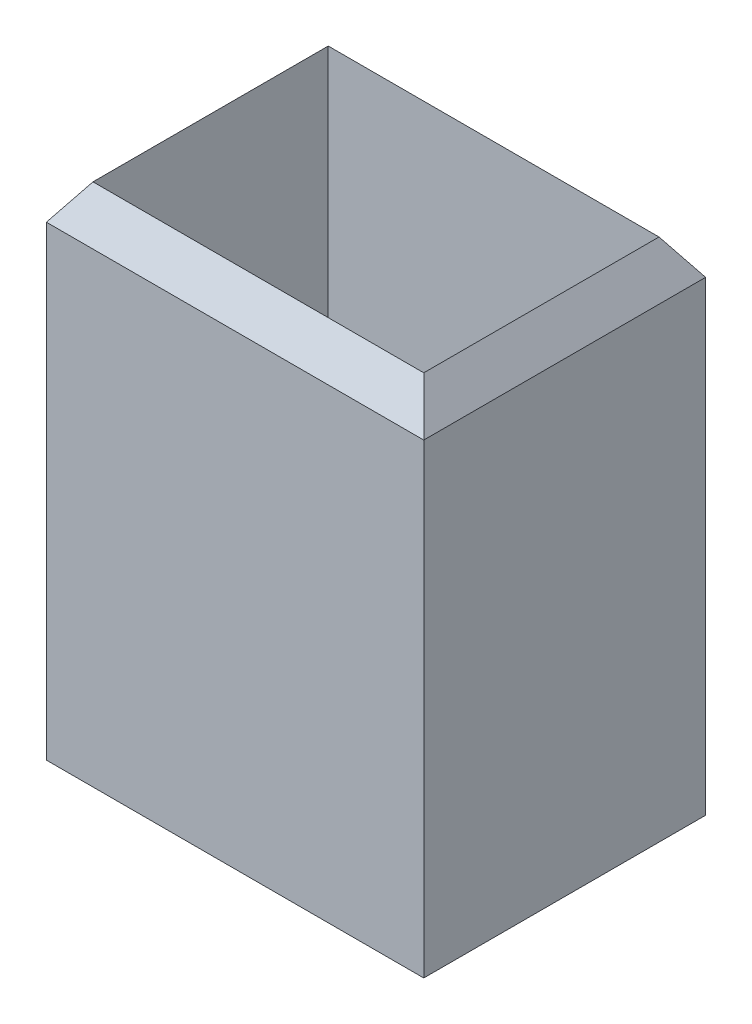
ISO-10303-21;
HEADER;
FILE_DESCRIPTION(('STEP AP214'),'2;1');
FILE_NAME('part.step','',(''),(''),'','','');
FILE_SCHEMA(('AUTOMOTIVE_DESIGN { 1 0 10303 214 1 1 1 1 }'));
ENDSEC;
DATA;
#1=APPLICATION_CONTEXT('core data for automotive mechanical design processes');
#2=APPLICATION_PROTOCOL_DEFINITION('international standard','automotive_design',2000,#1);
#3=PRODUCT_CONTEXT('',#1,'mechanical');
#4=PRODUCT('Part','Part','',(#3));
#5=PRODUCT_RELATED_PRODUCT_CATEGORY('part','',(#4));
#6=PRODUCT_DEFINITION_FORMATION('','',#4);
#7=PRODUCT_DEFINITION_CONTEXT('part definition',#1,'design');
#8=PRODUCT_DEFINITION('design','',#6,#7);
#9=PRODUCT_DEFINITION_SHAPE('','',#8);
#10=(LENGTH_UNIT() NAMED_UNIT(*) SI_UNIT(.MILLI.,.METRE.));
#11=(NAMED_UNIT(*) PLANE_ANGLE_UNIT() SI_UNIT($,.RADIAN.));
#12=(NAMED_UNIT(*) SI_UNIT($,.STERADIAN.) SOLID_ANGLE_UNIT());
#13=UNCERTAINTY_MEASURE_WITH_UNIT(LENGTH_MEASURE(1.E-05),#10,'distance_accuracy_value','');
#14=(GEOMETRIC_REPRESENTATION_CONTEXT(3) GLOBAL_UNCERTAINTY_ASSIGNED_CONTEXT((#13)) GLOBAL_UNIT_ASSIGNED_CONTEXT((#10,
#11,#12)) REPRESENTATION_CONTEXT('',''));
#15=CARTESIAN_POINT('',(0.,0.,0.));
#16=DIRECTION('',(0.,0.,1.));
#17=DIRECTION('',(1.,0.,0.));
#18=AXIS2_PLACEMENT_3D('',#15,#16,#17);
#19=CARTESIAN_POINT('',(-8.1,20.,6.05));
#20=DIRECTION('',(1.,0.,0.));
#21=DIRECTION('',(0.,0.,-1.));
#22=AXIS2_PLACEMENT_3D('',#19,#20,#21);
#23=PLANE('',#22);
#24=DIRECTION('',(0.,0.,1.));
#25=VECTOR('',#24,1.);
#26=CARTESIAN_POINT('',(-8.1,0.,6.05));
#27=LINE('',#26,#25);
#28=CARTESIAN_POINT('',(-8.09999999999999,0.,-6.05));
#29=VERTEX_POINT('',#28);
#30=CARTESIAN_POINT('',(-8.1,0.,6.05));
#31=VERTEX_POINT('',#30);
#32=EDGE_CURVE('E228',#29,#31,#27,.T.);
#33=ORIENTED_EDGE('',*,*,#32,.T.);
#34=DIRECTION('',(0.,-1.,0.));
#35=VECTOR('',#34,1.);
#36=CARTESIAN_POINT('',(-8.1,20.,6.05));
#37=LINE('',#36,#35);
#38=CARTESIAN_POINT('',(-8.1,20.,6.05));
#39=VERTEX_POINT('',#38);
#40=EDGE_CURVE('E12',#39,#31,#37,.T.);
#41=ORIENTED_EDGE('',*,*,#40,.F.);
#42=DIRECTION('',(0.,0.,1.));
#43=VECTOR('',#42,1.);
#44=CARTESIAN_POINT('',(-8.09999999999999,20.,0.));
#45=LINE('',#44,#43);
#46=CARTESIAN_POINT('',(-8.09999999999999,20.,-6.05));
#47=VERTEX_POINT('',#46);
#48=EDGE_CURVE('E270',#47,#39,#45,.T.);
#49=ORIENTED_EDGE('',*,*,#48,.F.);
#50=DIRECTION('',(0.,-1.,0.));
#51=VECTOR('',#50,1.);
#52=CARTESIAN_POINT('',(-8.09999999999999,20.,-6.05));
#53=LINE('',#52,#51);
#54=EDGE_CURVE('E271',#47,#29,#53,.T.);
#55=ORIENTED_EDGE('',*,*,#54,.T.);
#56=EDGE_LOOP('',(#33,#41,#49,#55));
#57=FACE_BOUND('',#56,.T.);
#58=ADVANCED_FACE('F42',(#57),#23,.F.);
#59=CARTESIAN_POINT('',(-8.1,20.,6.05));
#60=DIRECTION('',(0.,0.,-1.));
#61=DIRECTION('',(-1.,0.,0.));
#62=AXIS2_PLACEMENT_3D('',#59,#60,#61);
#63=PLANE('',#62);
#64=DIRECTION('',(1.,0.,0.));
#65=VECTOR('',#64,1.);
#66=CARTESIAN_POINT('',(-8.1,0.,6.05));
#67=LINE('',#66,#65);
#68=CARTESIAN_POINT('',(8.1,0.,6.05));
#69=VERTEX_POINT('',#68);
#70=EDGE_CURVE('E265',#31,#69,#67,.T.);
#71=ORIENTED_EDGE('',*,*,#70,.T.);
#72=DIRECTION('',(0.,-1.,0.));
#73=VECTOR('',#72,1.);
#74=CARTESIAN_POINT('',(8.1,20.,6.05));
#75=LINE('',#74,#73);
#76=CARTESIAN_POINT('',(8.1,20.,6.05));
#77=VERTEX_POINT('',#76);
#78=EDGE_CURVE('E51',#77,#69,#75,.T.);
#79=ORIENTED_EDGE('',*,*,#78,.F.);
#80=DIRECTION('',(1.,0.,0.));
#81=VECTOR('',#80,1.);
#82=CARTESIAN_POINT('',(0.,20.,6.05));
#83=LINE('',#82,#81);
#84=EDGE_CURVE('E80',#39,#77,#83,.T.);
#85=ORIENTED_EDGE('',*,*,#84,.F.);
#86=ORIENTED_EDGE('',*,*,#40,.T.);
#87=EDGE_LOOP('',(#71,#79,#85,#86));
#88=FACE_BOUND('',#87,.T.);
#89=ADVANCED_FACE('F317',(#88),#63,.F.);
#90=CARTESIAN_POINT('',(8.1,20.,6.05));
#91=DIRECTION('',(-1.,0.,0.));
#92=DIRECTION('',(0.,0.,1.));
#93=AXIS2_PLACEMENT_3D('',#90,#91,#92);
#94=PLANE('',#93);
#95=DIRECTION('',(0.,0.,-1.));
#96=VECTOR('',#95,1.);
#97=CARTESIAN_POINT('',(8.1,0.,6.05));
#98=LINE('',#97,#96);
#99=CARTESIAN_POINT('',(8.1,0.,-6.05));
#100=VERTEX_POINT('',#99);
#101=EDGE_CURVE('E267',#69,#100,#98,.T.);
#102=ORIENTED_EDGE('',*,*,#101,.T.);
#103=DIRECTION('',(0.,-1.,0.));
#104=VECTOR('',#103,1.);
#105=CARTESIAN_POINT('',(8.1,20.,-6.05));
#106=LINE('',#105,#104);
#107=CARTESIAN_POINT('',(8.09999999999999,20.,-6.05));
#108=VERTEX_POINT('',#107);
#109=EDGE_CURVE('E68',#108,#100,#106,.T.);
#110=ORIENTED_EDGE('',*,*,#109,.F.);
#111=DIRECTION('',(0.,0.,1.));
#112=VECTOR('',#111,1.);
#113=CARTESIAN_POINT('',(8.1,20.,0.));
#114=LINE('',#113,#112);
#115=EDGE_CURVE('E281',#77,#108,#114,.F.);
#116=ORIENTED_EDGE('',*,*,#115,.F.);
#117=ORIENTED_EDGE('',*,*,#78,.T.);
#118=EDGE_LOOP('',(#102,#110,#116,#117));
#119=FACE_BOUND('',#118,.T.);
#120=ADVANCED_FACE('F322',(#119),#94,.F.);
#121=CARTESIAN_POINT('',(-8.09999999999999,20.,-6.05));
#122=DIRECTION('',(0.,0.,1.));
#123=DIRECTION('',(1.,0.,0.));
#124=AXIS2_PLACEMENT_3D('',#121,#122,#123);
#125=PLANE('',#124);
#126=DIRECTION('',(-1.,0.,0.));
#127=VECTOR('',#126,1.);
#128=CARTESIAN_POINT('',(-8.09999999999999,0.,-6.05));
#129=LINE('',#128,#127);
#130=EDGE_CURVE('E87',#100,#29,#129,.T.);
#131=ORIENTED_EDGE('',*,*,#130,.T.);
#132=ORIENTED_EDGE('',*,*,#54,.F.);
#133=DIRECTION('',(1.,0.,0.));
#134=VECTOR('',#133,1.);
#135=CARTESIAN_POINT('',(0.,20.,-6.05));
#136=LINE('',#135,#134);
#137=EDGE_CURVE('E273',#108,#47,#136,.F.);
#138=ORIENTED_EDGE('',*,*,#137,.F.);
#139=ORIENTED_EDGE('',*,*,#109,.T.);
#140=EDGE_LOOP('',(#131,#132,#138,#139));
#141=FACE_BOUND('',#140,.T.);
#142=ADVANCED_FACE('F329',(#141),#125,.F.);
#143=CARTESIAN_POINT('',(0.,0.,0.));
#144=DIRECTION('',(0.,-1.,0.));
#145=DIRECTION('',(0.,0.,-1.));
#146=AXIS2_PLACEMENT_3D('',#143,#144,#145);
#147=PLANE('',#146);
#148=DIRECTION('',(0.,0.,-1.));
#149=VECTOR('',#148,1.);
#150=CARTESIAN_POINT('',(7.1,0.,5.05));
#151=LINE('',#150,#149);
#152=CARTESIAN_POINT('',(7.1,0.,5.05));
#153=VERTEX_POINT('',#152);
#154=CARTESIAN_POINT('',(7.1,0.,-5.05));
#155=VERTEX_POINT('',#154);
#156=EDGE_CURVE('E123',#153,#155,#151,.T.);
#157=ORIENTED_EDGE('',*,*,#156,.T.);
#158=DIRECTION('',(-1.,0.,0.));
#159=VECTOR('',#158,1.);
#160=CARTESIAN_POINT('',(-7.1,0.,-5.05));
#161=LINE('',#160,#159);
#162=CARTESIAN_POINT('',(-7.1,0.,-5.05));
#163=VERTEX_POINT('',#162);
#164=EDGE_CURVE('E134',#155,#163,#161,.T.);
#165=ORIENTED_EDGE('',*,*,#164,.T.);
#166=DIRECTION('',(0.,0.,1.));
#167=VECTOR('',#166,1.);
#168=CARTESIAN_POINT('',(-7.1,0.,5.05));
#169=LINE('',#168,#167);
#170=CARTESIAN_POINT('',(-7.1,0.,5.05));
#171=VERTEX_POINT('',#170);
#172=EDGE_CURVE('E59',#163,#171,#169,.T.);
#173=ORIENTED_EDGE('',*,*,#172,.T.);
#174=DIRECTION('',(1.,0.,0.));
#175=VECTOR('',#174,1.);
#176=CARTESIAN_POINT('',(-7.1,0.,5.05));
#177=LINE('',#176,#175);
#178=EDGE_CURVE('E131',#171,#153,#177,.T.);
#179=ORIENTED_EDGE('',*,*,#178,.T.);
#180=EDGE_LOOP('',(#157,#165,#173,#179));
#181=FACE_BOUND('',#180,.T.);
#182=ORIENTED_EDGE('',*,*,#32,.F.);
#183=ORIENTED_EDGE('',*,*,#130,.F.);
#184=ORIENTED_EDGE('',*,*,#101,.F.);
#185=ORIENTED_EDGE('',*,*,#70,.F.);
#186=EDGE_LOOP('',(#182,#183,#184,#185));
#187=FACE_BOUND('',#186,.T.);
#188=ADVANCED_FACE('F138',(#181,#187),#147,.T.);
#189=CARTESIAN_POINT('',(14.8384615384615,9.89230769230766,0.));
#190=DIRECTION('',(-0.832050294337845,-0.554700196225228,0.));
#191=DIRECTION('',(0.554700196225228,-0.832050294337845,0.));
#192=AXIS2_PLACEMENT_3D('',#189,#190,#191);
#193=PLANE('',#192);
#194=DIRECTION('',(-0.485071250072665,0.727606875109,0.485071250072666));
#195=VECTOR('',#194,1.);
#196=CARTESIAN_POINT('',(8.1,20.,-6.05));
#197=LINE('',#196,#195);
#198=CARTESIAN_POINT('',(7.1,21.5,-5.05));
#199=VERTEX_POINT('',#198);
#200=EDGE_CURVE('E145',#108,#199,#197,.T.);
#201=ORIENTED_EDGE('',*,*,#200,.T.);
#202=DIRECTION('',(0.,0.,-1.));
#203=VECTOR('',#202,1.);
#204=CARTESIAN_POINT('',(7.1,21.5,5.05));
#205=LINE('',#204,#203);
#206=CARTESIAN_POINT('',(7.1,21.5,5.05));
#207=VERTEX_POINT('',#206);
#208=EDGE_CURVE('E126',#207,#199,#205,.T.);
#209=ORIENTED_EDGE('',*,*,#208,.F.);
#210=DIRECTION('',(-0.485071250072666,0.727606875108999,-0.485071250072665));
#211=VECTOR('',#210,1.);
#212=CARTESIAN_POINT('',(8.1,20.,6.05));
#213=LINE('',#212,#211);
#214=EDGE_CURVE('E148',#77,#207,#213,.T.);
#215=ORIENTED_EDGE('',*,*,#214,.F.);
#216=ORIENTED_EDGE('',*,*,#115,.T.);
#217=EDGE_LOOP('',(#201,#209,#215,#216));
#218=FACE_BOUND('',#217,.T.);
#219=ADVANCED_FACE('F188',(#218),#193,.F.);
#220=CARTESIAN_POINT('',(0.,8.94615384615383,13.4192307692308));
#221=DIRECTION('',(0.,-0.554700196225228,-0.832050294337844));
#222=DIRECTION('',(0.,0.832050294337844,-0.554700196225228));
#223=AXIS2_PLACEMENT_3D('',#220,#221,#222);
#224=PLANE('',#223);
#225=ORIENTED_EDGE('',*,*,#214,.T.);
#226=DIRECTION('',(1.,0.,0.));
#227=VECTOR('',#226,1.);
#228=CARTESIAN_POINT('',(-7.1,21.5,5.05));
#229=LINE('',#228,#227);
#230=CARTESIAN_POINT('',(-7.1,21.5,5.05));
#231=VERTEX_POINT('',#230);
#232=EDGE_CURVE('E171',#231,#207,#229,.T.);
#233=ORIENTED_EDGE('',*,*,#232,.F.);
#234=DIRECTION('',(0.485071250072665,0.727606875109,-0.485071250072665));
#235=VECTOR('',#234,1.);
#236=CARTESIAN_POINT('',(-8.1,20.,6.05));
#237=LINE('',#236,#235);
#238=EDGE_CURVE('E155',#39,#231,#237,.T.);
#239=ORIENTED_EDGE('',*,*,#238,.F.);
#240=ORIENTED_EDGE('',*,*,#84,.T.);
#241=EDGE_LOOP('',(#225,#233,#239,#240));
#242=FACE_BOUND('',#241,.T.);
#243=ADVANCED_FACE('F177',(#242),#224,.F.);
#244=CARTESIAN_POINT('',(0.,8.94615384615384,-13.4192307692308));
#245=DIRECTION('',(0.,-0.554700196225229,0.832050294337844));
#246=DIRECTION('',(0.,-0.832050294337844,-0.554700196225229));
#247=AXIS2_PLACEMENT_3D('',#244,#245,#246);
#248=PLANE('',#247);
#249=DIRECTION('',(0.485071250072661,0.727606875109001,0.485071250072667));
#250=VECTOR('',#249,1.);
#251=CARTESIAN_POINT('',(-8.09999999999999,20.,-6.05));
#252=LINE('',#251,#250);
#253=CARTESIAN_POINT('',(-7.1,21.5,-5.05));
#254=VERTEX_POINT('',#253);
#255=EDGE_CURVE('E152',#47,#254,#252,.T.);
#256=ORIENTED_EDGE('',*,*,#255,.T.);
#257=DIRECTION('',(-1.,0.,0.));
#258=VECTOR('',#257,1.);
#259=CARTESIAN_POINT('',(-7.1,21.5,-5.05));
#260=LINE('',#259,#258);
#261=EDGE_CURVE('E45',#199,#254,#260,.T.);
#262=ORIENTED_EDGE('',*,*,#261,.F.);
#263=ORIENTED_EDGE('',*,*,#200,.F.);
#264=ORIENTED_EDGE('',*,*,#137,.T.);
#265=EDGE_LOOP('',(#256,#262,#263,#264));
#266=FACE_BOUND('',#265,.T.);
#267=ADVANCED_FACE('F187',(#266),#248,.F.);
#268=CARTESIAN_POINT('',(-14.8384615384615,9.89230769230766,0.));
#269=DIRECTION('',(0.832050294337844,-0.554700196225228,0.));
#270=DIRECTION('',(0.554700196225228,0.832050294337845,0.));
#271=AXIS2_PLACEMENT_3D('',#268,#269,#270);
#272=PLANE('',#271);
#273=ORIENTED_EDGE('',*,*,#238,.T.);
#274=DIRECTION('',(0.,0.,1.));
#275=VECTOR('',#274,1.);
#276=CARTESIAN_POINT('',(-7.1,21.5,5.05));
#277=LINE('',#276,#275);
#278=EDGE_CURVE('E213',#254,#231,#277,.T.);
#279=ORIENTED_EDGE('',*,*,#278,.F.);
#280=ORIENTED_EDGE('',*,*,#255,.F.);
#281=ORIENTED_EDGE('',*,*,#48,.T.);
#282=EDGE_LOOP('',(#273,#279,#280,#281));
#283=FACE_BOUND('',#282,.T.);
#284=ADVANCED_FACE('F194',(#283),#272,.F.);
#285=CARTESIAN_POINT('',(7.1,0.,5.05));
#286=DIRECTION('',(1.,0.,0.));
#287=DIRECTION('',(0.,0.,-1.));
#288=AXIS2_PLACEMENT_3D('',#285,#286,#287);
#289=PLANE('',#288);
#290=ORIENTED_EDGE('',*,*,#208,.T.);
#291=DIRECTION('',(0.,1.,0.));
#292=VECTOR('',#291,1.);
#293=CARTESIAN_POINT('',(7.1,0.,-5.05));
#294=LINE('',#293,#292);
#295=EDGE_CURVE('E119',#155,#199,#294,.T.);
#296=ORIENTED_EDGE('',*,*,#295,.F.);
#297=ORIENTED_EDGE('',*,*,#156,.F.);
#298=DIRECTION('',(0.,1.,0.));
#299=VECTOR('',#298,1.);
#300=CARTESIAN_POINT('',(7.1,0.,5.05));
#301=LINE('',#300,#299);
#302=EDGE_CURVE('E149',#153,#207,#301,.T.);
#303=ORIENTED_EDGE('',*,*,#302,.T.);
#304=EDGE_LOOP('',(#290,#296,#297,#303));
#305=FACE_BOUND('',#304,.T.);
#306=ADVANCED_FACE('F121',(#305),#289,.F.);
#307=CARTESIAN_POINT('',(-7.1,0.,5.05));
#308=DIRECTION('',(0.,0.,1.));
#309=DIRECTION('',(1.,0.,0.));
#310=AXIS2_PLACEMENT_3D('',#307,#308,#309);
#311=PLANE('',#310);
#312=ORIENTED_EDGE('',*,*,#232,.T.);
#313=ORIENTED_EDGE('',*,*,#302,.F.);
#314=ORIENTED_EDGE('',*,*,#178,.F.);
#315=DIRECTION('',(0.,1.,0.));
#316=VECTOR('',#315,1.);
#317=CARTESIAN_POINT('',(-7.1,0.,5.05));
#318=LINE('',#317,#316);
#319=EDGE_CURVE('E286',#171,#231,#318,.T.);
#320=ORIENTED_EDGE('',*,*,#319,.T.);
#321=EDGE_LOOP('',(#312,#313,#314,#320));
#322=FACE_BOUND('',#321,.T.);
#323=ADVANCED_FACE('F243',(#322),#311,.F.);
#324=CARTESIAN_POINT('',(-7.1,0.,5.05));
#325=DIRECTION('',(-1.,0.,0.));
#326=DIRECTION('',(0.,0.,1.));
#327=AXIS2_PLACEMENT_3D('',#324,#325,#326);
#328=PLANE('',#327);
#329=ORIENTED_EDGE('',*,*,#278,.T.);
#330=ORIENTED_EDGE('',*,*,#319,.F.);
#331=ORIENTED_EDGE('',*,*,#172,.F.);
#332=DIRECTION('',(0.,1.,0.));
#333=VECTOR('',#332,1.);
#334=CARTESIAN_POINT('',(-7.1,0.,-5.05));
#335=LINE('',#334,#333);
#336=EDGE_CURVE('E130',#163,#254,#335,.T.);
#337=ORIENTED_EDGE('',*,*,#336,.T.);
#338=EDGE_LOOP('',(#329,#330,#331,#337));
#339=FACE_BOUND('',#338,.T.);
#340=ADVANCED_FACE('F247',(#339),#328,.F.);
#341=CARTESIAN_POINT('',(-7.1,0.,-5.05));
#342=DIRECTION('',(0.,0.,-1.));
#343=DIRECTION('',(-1.,0.,0.));
#344=AXIS2_PLACEMENT_3D('',#341,#342,#343);
#345=PLANE('',#344);
#346=ORIENTED_EDGE('',*,*,#261,.T.);
#347=ORIENTED_EDGE('',*,*,#336,.F.);
#348=ORIENTED_EDGE('',*,*,#164,.F.);
#349=ORIENTED_EDGE('',*,*,#295,.T.);
#350=EDGE_LOOP('',(#346,#347,#348,#349));
#351=FACE_BOUND('',#350,.T.);
#352=ADVANCED_FACE('F135',(#351),#345,.F.);
#353=CLOSED_SHELL('',(#58,#89,#120,#142,#188,#219,#243,#267,#284,#306,#323,#340,#352));
#354=MANIFOLD_SOLID_BREP('B2',#353);
#355=ADVANCED_BREP_SHAPE_REPRESENTATION('',(#18,#354),#14);
#356=SHAPE_DEFINITION_REPRESENTATION(#9,#355);
ENDSEC;
END-ISO-10303-21;
